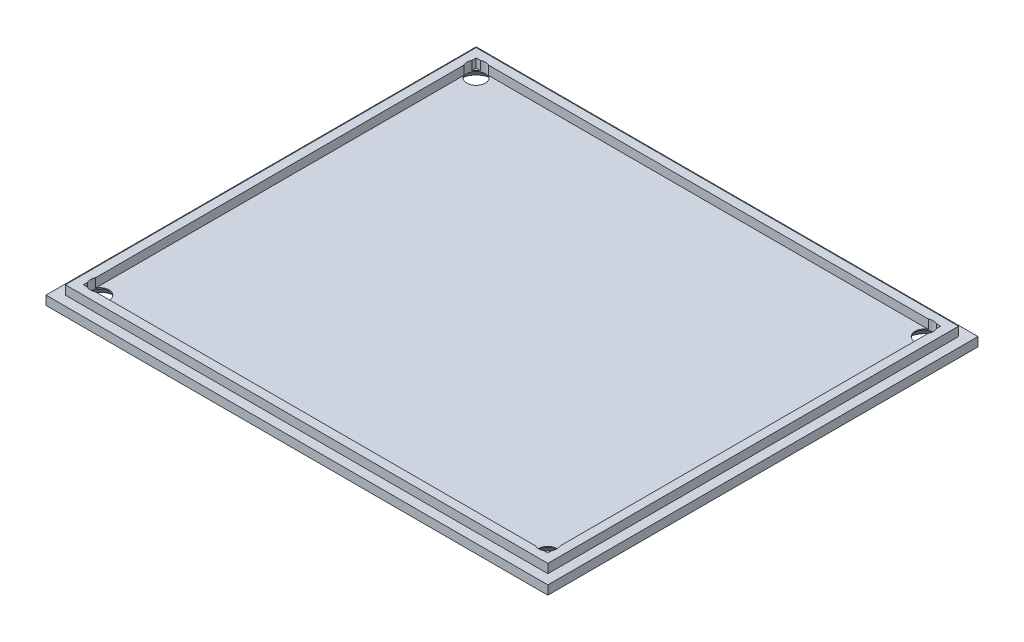
ISO-10303-21;
HEADER;
FILE_DESCRIPTION(('STEP AP214'),'2;1');
FILE_NAME('part.step','',(''),(''),'','','');
FILE_SCHEMA(('AUTOMOTIVE_DESIGN { 1 0 10303 214 1 1 1 1 }'));
ENDSEC;
DATA;
#1=APPLICATION_CONTEXT('core data for automotive mechanical design processes');
#2=APPLICATION_PROTOCOL_DEFINITION('international standard','automotive_design',2000,#1);
#3=PRODUCT_CONTEXT('',#1,'mechanical');
#4=PRODUCT('Part','Part','',(#3));
#5=PRODUCT_RELATED_PRODUCT_CATEGORY('part','',(#4));
#6=PRODUCT_DEFINITION_FORMATION('','',#4);
#7=PRODUCT_DEFINITION_CONTEXT('part definition',#1,'design');
#8=PRODUCT_DEFINITION('design','',#6,#7);
#9=PRODUCT_DEFINITION_SHAPE('','',#8);
#10=(LENGTH_UNIT() NAMED_UNIT(*) SI_UNIT(.MILLI.,.METRE.));
#11=(NAMED_UNIT(*) PLANE_ANGLE_UNIT() SI_UNIT($,.RADIAN.));
#12=(NAMED_UNIT(*) SI_UNIT($,.STERADIAN.) SOLID_ANGLE_UNIT());
#13=UNCERTAINTY_MEASURE_WITH_UNIT(LENGTH_MEASURE(1.E-05),#10,'distance_accuracy_value','');
#14=(GEOMETRIC_REPRESENTATION_CONTEXT(3) GLOBAL_UNCERTAINTY_ASSIGNED_CONTEXT((#13)) GLOBAL_UNIT_ASSIGNED_CONTEXT((#10,
#11,#12)) REPRESENTATION_CONTEXT('',''));
#15=CARTESIAN_POINT('',(0.,0.,0.));
#16=DIRECTION('',(0.,0.,1.));
#17=DIRECTION('',(1.,0.,0.));
#18=AXIS2_PLACEMENT_3D('',#15,#16,#17);
#19=CARTESIAN_POINT('',(41.148,3.175,34.798));
#20=DIRECTION('',(-1.,0.,0.));
#21=DIRECTION('',(0.,0.,1.));
#22=AXIS2_PLACEMENT_3D('',#19,#20,#21);
#23=PLANE('',#22);
#24=DIRECTION('',(0.,-1.,0.));
#25=VECTOR('',#24,1.);
#26=CARTESIAN_POINT('',(41.148,0.,-34.0656487159227));
#27=LINE('',#26,#25);
#28=CARTESIAN_POINT('',(41.148,3.175,-34.0656487159227));
#29=VERTEX_POINT('',#28);
#30=CARTESIAN_POINT('',(41.148,1.5875,-34.0656487159227));
#31=VERTEX_POINT('',#30);
#32=EDGE_CURVE('E454',#29,#31,#27,.T.);
#33=ORIENTED_EDGE('',*,*,#32,.F.);
#34=DIRECTION('',(0.,0.,-1.));
#35=VECTOR('',#34,1.);
#36=CARTESIAN_POINT('',(41.148,3.175,34.798));
#37=LINE('',#36,#35);
#38=CARTESIAN_POINT('',(41.148,3.175,-34.798));
#39=VERTEX_POINT('',#38);
#40=EDGE_CURVE('E428',#29,#39,#37,.T.);
#41=ORIENTED_EDGE('',*,*,#40,.T.);
#42=DIRECTION('',(0.,-1.,0.));
#43=VECTOR('',#42,1.);
#44=CARTESIAN_POINT('',(41.148,3.175,-34.798));
#45=LINE('',#44,#43);
#46=CARTESIAN_POINT('',(41.148,1.5875,-34.798));
#47=VERTEX_POINT('',#46);
#48=EDGE_CURVE('E276',#39,#47,#45,.T.);
#49=ORIENTED_EDGE('',*,*,#48,.T.);
#50=DIRECTION('',(0.,0.,-1.));
#51=VECTOR('',#50,1.);
#52=CARTESIAN_POINT('',(41.148,1.5875,34.798));
#53=LINE('',#52,#51);
#54=EDGE_CURVE('E254',#31,#47,#53,.T.);
#55=ORIENTED_EDGE('',*,*,#54,.F.);
#56=EDGE_LOOP('',(#33,#41,#49,#55));
#57=FACE_BOUND('',#56,.T.);
#58=ADVANCED_FACE('F32',(#57),#23,.T.);
#59=CARTESIAN_POINT('',(0.,1.5875,0.));
#60=DIRECTION('',(0.,1.,0.));
#61=DIRECTION('',(0.,0.,1.));
#62=AXIS2_PLACEMENT_3D('',#59,#60,#61);
#63=PLANE('',#62);
#64=CARTESIAN_POINT('',(39.6875,1.5875,-33.3375));
#65=DIRECTION('',(0.,1.,0.));
#66=DIRECTION('',(0.,0.,1.));
#67=AXIS2_PLACEMENT_3D('',#64,#65,#66);
#68=CIRCLE('',#67,1.63195);
#69=CARTESIAN_POINT('',(40.4156487159227,1.5875,-34.798));
#70=VERTEX_POINT('',#69);
#71=EDGE_CURVE('E459',#31,#70,#68,.T.);
#72=ORIENTED_EDGE('',*,*,#71,.F.);
#73=ORIENTED_EDGE('',*,*,#54,.T.);
#74=DIRECTION('',(-1.,0.,0.));
#75=VECTOR('',#74,1.);
#76=CARTESIAN_POINT('',(41.148,1.5875,-34.798));
#77=LINE('',#76,#75);
#78=EDGE_CURVE('E262',#47,#70,#77,.T.);
#79=ORIENTED_EDGE('',*,*,#78,.T.);
#80=EDGE_LOOP('',(#72,#73,#79));
#81=FACE_BOUND('',#80,.T.);
#82=ADVANCED_FACE('F539',(#81),#63,.T.);
#83=CARTESIAN_POINT('',(41.148,3.175,-34.798));
#84=DIRECTION('',(0.,0.,1.));
#85=DIRECTION('',(1.,0.,0.));
#86=AXIS2_PLACEMENT_3D('',#83,#84,#85);
#87=PLANE('',#86);
#88=DIRECTION('',(0.,-1.,0.));
#89=VECTOR('',#88,1.);
#90=CARTESIAN_POINT('',(38.9593512840772,0.,-34.798));
#91=LINE('',#90,#89);
#92=CARTESIAN_POINT('',(38.9593512840772,3.175,-34.798));
#93=VERTEX_POINT('',#92);
#94=CARTESIAN_POINT('',(38.9593512840772,1.5875,-34.798));
#95=VERTEX_POINT('',#94);
#96=EDGE_CURVE('E218',#93,#95,#91,.T.);
#97=ORIENTED_EDGE('',*,*,#96,.F.);
#98=DIRECTION('',(-1.,0.,0.));
#99=VECTOR('',#98,1.);
#100=CARTESIAN_POINT('',(41.148,3.175,-34.798));
#101=LINE('',#100,#99);
#102=CARTESIAN_POINT('',(-38.9593512840772,3.175,-34.798));
#103=VERTEX_POINT('',#102);
#104=EDGE_CURVE('E55',#93,#103,#101,.T.);
#105=ORIENTED_EDGE('',*,*,#104,.T.);
#106=DIRECTION('',(0.,-1.,0.));
#107=VECTOR('',#106,1.);
#108=CARTESIAN_POINT('',(-38.9593512840772,0.,-34.798));
#109=LINE('',#108,#107);
#110=CARTESIAN_POINT('',(-38.9593512840772,1.5875,-34.798));
#111=VERTEX_POINT('',#110);
#112=EDGE_CURVE('E369',#111,#103,#109,.F.);
#113=ORIENTED_EDGE('',*,*,#112,.F.);
#114=EDGE_CURVE('E228',#95,#111,#77,.T.);
#115=ORIENTED_EDGE('',*,*,#114,.F.);
#116=EDGE_LOOP('',(#97,#105,#113,#115));
#117=FACE_BOUND('',#116,.T.);
#118=ADVANCED_FACE('F227',(#117),#87,.T.);
#119=CARTESIAN_POINT('',(-39.6875,1.5875,-33.3375));
#120=DIRECTION('',(0.,1.,0.));
#121=DIRECTION('',(0.,0.,1.));
#122=AXIS2_PLACEMENT_3D('',#119,#120,#121);
#123=CIRCLE('',#122,1.63195);
#124=CARTESIAN_POINT('',(-40.4156487159229,1.5875,-34.798));
#125=VERTEX_POINT('',#124);
#126=CARTESIAN_POINT('',(-41.148,1.5875,-34.0656487159228));
#127=VERTEX_POINT('',#126);
#128=EDGE_CURVE('E372',#125,#127,#123,.T.);
#129=ORIENTED_EDGE('',*,*,#128,.F.);
#130=CARTESIAN_POINT('',(-41.148,1.5875,-34.798));
#131=VERTEX_POINT('',#130);
#132=EDGE_CURVE('E260',#125,#131,#77,.T.);
#133=ORIENTED_EDGE('',*,*,#132,.T.);
#134=DIRECTION('',(0.,0.,1.));
#135=VECTOR('',#134,1.);
#136=CARTESIAN_POINT('',(-41.148,1.5875,-34.798));
#137=LINE('',#136,#135);
#138=EDGE_CURVE('E266',#131,#127,#137,.T.);
#139=ORIENTED_EDGE('',*,*,#138,.T.);
#140=EDGE_LOOP('',(#129,#133,#139));
#141=FACE_BOUND('',#140,.T.);
#142=ADVANCED_FACE('F545',(#141),#63,.T.);
#143=DIRECTION('',(0.,-1.,0.));
#144=VECTOR('',#143,1.);
#145=CARTESIAN_POINT('',(-40.4156487159229,0.,-34.798));
#146=LINE('',#145,#144);
#147=CARTESIAN_POINT('',(-40.4156487159229,3.175,-34.798));
#148=VERTEX_POINT('',#147);
#149=EDGE_CURVE('E370',#148,#125,#146,.T.);
#150=ORIENTED_EDGE('',*,*,#149,.F.);
#151=CARTESIAN_POINT('',(-41.148,3.175,-34.798));
#152=VERTEX_POINT('',#151);
#153=EDGE_CURVE('E239',#148,#152,#101,.T.);
#154=ORIENTED_EDGE('',*,*,#153,.T.);
#155=DIRECTION('',(0.,-1.,0.));
#156=VECTOR('',#155,1.);
#157=CARTESIAN_POINT('',(-41.148,3.175,-34.798));
#158=LINE('',#157,#156);
#159=EDGE_CURVE('E273',#152,#131,#158,.T.);
#160=ORIENTED_EDGE('',*,*,#159,.T.);
#161=ORIENTED_EDGE('',*,*,#132,.F.);
#162=EDGE_LOOP('',(#150,#154,#160,#161));
#163=FACE_BOUND('',#162,.T.);
#164=ADVANCED_FACE('F555',(#163),#87,.T.);
#165=CARTESIAN_POINT('',(-41.148,3.175,-34.798));
#166=DIRECTION('',(1.,0.,0.));
#167=DIRECTION('',(0.,0.,-1.));
#168=AXIS2_PLACEMENT_3D('',#165,#166,#167);
#169=PLANE('',#168);
#170=DIRECTION('',(0.,-1.,0.));
#171=VECTOR('',#170,1.);
#172=CARTESIAN_POINT('',(-41.148,0.,-32.6093512840772));
#173=LINE('',#172,#171);
#174=CARTESIAN_POINT('',(-41.148,3.175,-32.6093512840772));
#175=VERTEX_POINT('',#174);
#176=CARTESIAN_POINT('',(-41.148,1.5875,-32.6093512840772));
#177=VERTEX_POINT('',#176);
#178=EDGE_CURVE('E40',#175,#177,#173,.T.);
#179=ORIENTED_EDGE('',*,*,#178,.F.);
#180=DIRECTION('',(0.,0.,1.));
#181=VECTOR('',#180,1.);
#182=CARTESIAN_POINT('',(-41.148,3.175,-34.798));
#183=LINE('',#182,#181);
#184=CARTESIAN_POINT('',(-41.148,3.175,32.6093512840771));
#185=VERTEX_POINT('',#184);
#186=EDGE_CURVE('E250',#175,#185,#183,.T.);
#187=ORIENTED_EDGE('',*,*,#186,.T.);
#188=DIRECTION('',(0.,-1.,0.));
#189=VECTOR('',#188,1.);
#190=CARTESIAN_POINT('',(-41.148,0.,32.6093512840771));
#191=LINE('',#190,#189);
#192=CARTESIAN_POINT('',(-41.148,1.5875,32.6093512840771));
#193=VERTEX_POINT('',#192);
#194=EDGE_CURVE('E376',#193,#185,#191,.F.);
#195=ORIENTED_EDGE('',*,*,#194,.F.);
#196=EDGE_CURVE('E270',#177,#193,#137,.T.);
#197=ORIENTED_EDGE('',*,*,#196,.F.);
#198=EDGE_LOOP('',(#179,#187,#195,#197));
#199=FACE_BOUND('',#198,.T.);
#200=ADVANCED_FACE('F374',(#199),#169,.T.);
#201=CARTESIAN_POINT('',(0.,3.175,0.));
#202=DIRECTION('',(0.,1.,0.));
#203=DIRECTION('',(0.,0.,1.));
#204=AXIS2_PLACEMENT_3D('',#201,#202,#203);
#205=PLANE('',#204);
#206=CARTESIAN_POINT('',(39.6875,3.175,-33.3375));
#207=DIRECTION('',(0.,1.,0.));
#208=DIRECTION('',(0.,0.,1.));
#209=AXIS2_PLACEMENT_3D('',#206,#207,#208);
#210=CIRCLE('',#209,1.63195);
#211=CARTESIAN_POINT('',(41.148,3.175,-32.6093512840773));
#212=VERTEX_POINT('',#211);
#213=EDGE_CURVE('E11',#212,#29,#210,.T.);
#214=ORIENTED_EDGE('',*,*,#213,.F.);
#215=CARTESIAN_POINT('',(41.148,3.175,32.6093512840773));
#216=VERTEX_POINT('',#215);
#217=EDGE_CURVE('E430',#216,#212,#37,.T.);
#218=ORIENTED_EDGE('',*,*,#217,.F.);
#219=CARTESIAN_POINT('',(39.6875,3.175,33.3375));
#220=DIRECTION('',(0.,1.,0.));
#221=DIRECTION('',(0.,0.,1.));
#222=AXIS2_PLACEMENT_3D('',#219,#220,#221);
#223=CIRCLE('',#222,1.63195);
#224=CARTESIAN_POINT('',(41.148,3.175,34.0656487159227));
#225=VERTEX_POINT('',#224);
#226=EDGE_CURVE('E346',#216,#225,#223,.F.);
#227=ORIENTED_EDGE('',*,*,#226,.T.);
#228=CARTESIAN_POINT('',(41.148,3.175,34.798));
#229=VERTEX_POINT('',#228);
#230=EDGE_CURVE('E242',#229,#225,#37,.T.);
#231=ORIENTED_EDGE('',*,*,#230,.F.);
#232=DIRECTION('',(1.,0.,0.));
#233=VECTOR('',#232,1.);
#234=CARTESIAN_POINT('',(-41.148,3.175,34.798));
#235=LINE('',#234,#233);
#236=CARTESIAN_POINT('',(40.4156487159228,3.175,34.798));
#237=VERTEX_POINT('',#236);
#238=EDGE_CURVE('E269',#237,#229,#235,.T.);
#239=ORIENTED_EDGE('',*,*,#238,.F.);
#240=CARTESIAN_POINT('',(38.9593512840772,3.175,34.798));
#241=VERTEX_POINT('',#240);
#242=EDGE_CURVE('E341',#237,#241,#223,.F.);
#243=ORIENTED_EDGE('',*,*,#242,.T.);
#244=CARTESIAN_POINT('',(-38.9593512840773,3.175,34.798));
#245=VERTEX_POINT('',#244);
#246=EDGE_CURVE('E429',#245,#241,#235,.T.);
#247=ORIENTED_EDGE('',*,*,#246,.F.);
#248=CARTESIAN_POINT('',(-39.6875,3.175,33.3375));
#249=DIRECTION('',(0.,1.,0.));
#250=DIRECTION('',(0.,0.,1.));
#251=AXIS2_PLACEMENT_3D('',#248,#249,#250);
#252=CIRCLE('',#251,1.63195);
#253=CARTESIAN_POINT('',(-40.4156487159228,3.175,34.798));
#254=VERTEX_POINT('',#253);
#255=EDGE_CURVE('E403',#245,#254,#252,.F.);
#256=ORIENTED_EDGE('',*,*,#255,.T.);
#257=CARTESIAN_POINT('',(-41.148,3.175,34.798));
#258=VERTEX_POINT('',#257);
#259=EDGE_CURVE('E427',#258,#254,#235,.T.);
#260=ORIENTED_EDGE('',*,*,#259,.F.);
#261=CARTESIAN_POINT('',(-41.148,3.175,34.0656487159228));
#262=VERTEX_POINT('',#261);
#263=EDGE_CURVE('E241',#262,#258,#183,.T.);
#264=ORIENTED_EDGE('',*,*,#263,.F.);
#265=EDGE_CURVE('E398',#262,#185,#252,.F.);
#266=ORIENTED_EDGE('',*,*,#265,.T.);
#267=ORIENTED_EDGE('',*,*,#186,.F.);
#268=CARTESIAN_POINT('',(-39.6875,3.175,-33.3375));
#269=DIRECTION('',(0.,1.,0.));
#270=DIRECTION('',(0.,0.,1.));
#271=AXIS2_PLACEMENT_3D('',#268,#269,#270);
#272=CIRCLE('',#271,1.63195);
#273=CARTESIAN_POINT('',(-41.148,3.175,-34.0656487159228));
#274=VERTEX_POINT('',#273);
#275=EDGE_CURVE('E361',#175,#274,#272,.F.);
#276=ORIENTED_EDGE('',*,*,#275,.T.);
#277=EDGE_CURVE('E246',#152,#274,#183,.T.);
#278=ORIENTED_EDGE('',*,*,#277,.F.);
#279=ORIENTED_EDGE('',*,*,#153,.F.);
#280=EDGE_CURVE('E237',#148,#103,#272,.F.);
#281=ORIENTED_EDGE('',*,*,#280,.T.);
#282=ORIENTED_EDGE('',*,*,#104,.F.);
#283=CARTESIAN_POINT('',(39.6875,3.175,-33.3375));
#284=DIRECTION('',(0.,1.,0.));
#285=DIRECTION('',(0.,0.,1.));
#286=AXIS2_PLACEMENT_3D('',#283,#284,#285);
#287=CIRCLE('',#286,1.63195);
#288=CARTESIAN_POINT('',(40.4156487159227,3.175,-34.798));
#289=VERTEX_POINT('',#288);
#290=EDGE_CURVE('E215',#93,#289,#287,.F.);
#291=ORIENTED_EDGE('',*,*,#290,.T.);
#292=EDGE_CURVE('E238',#39,#289,#101,.T.);
#293=ORIENTED_EDGE('',*,*,#292,.F.);
#294=ORIENTED_EDGE('',*,*,#40,.F.);
#295=EDGE_LOOP('',(#214,#218,#227,#231,#239,#243,#247,#256,#260,#264,#266,#267,#276,#278,#279,
#281,#282,#291,#293,#294));
#296=FACE_BOUND('',#295,.T.);
#297=DIRECTION('',(1.,0.,0.));
#298=VECTOR('',#297,1.);
#299=CARTESIAN_POINT('',(-42.7355,3.175,36.3855));
#300=LINE('',#299,#298);
#301=CARTESIAN_POINT('',(-42.7355,3.175,36.3855));
#302=VERTEX_POINT('',#301);
#303=CARTESIAN_POINT('',(42.7355,3.175,36.3855));
#304=VERTEX_POINT('',#303);
#305=EDGE_CURVE('E283',#302,#304,#300,.T.);
#306=ORIENTED_EDGE('',*,*,#305,.T.);
#307=DIRECTION('',(0.,0.,-1.));
#308=VECTOR('',#307,1.);
#309=CARTESIAN_POINT('',(42.7355,3.175,36.3855));
#310=LINE('',#309,#308);
#311=CARTESIAN_POINT('',(42.7355,3.175,-36.3855));
#312=VERTEX_POINT('',#311);
#313=EDGE_CURVE('E286',#304,#312,#310,.T.);
#314=ORIENTED_EDGE('',*,*,#313,.T.);
#315=DIRECTION('',(-1.,0.,0.));
#316=VECTOR('',#315,1.);
#317=CARTESIAN_POINT('',(42.7355,3.175,-36.3855));
#318=LINE('',#317,#316);
#319=CARTESIAN_POINT('',(-42.7355,3.175,-36.3855));
#320=VERTEX_POINT('',#319);
#321=EDGE_CURVE('E289',#312,#320,#318,.T.);
#322=ORIENTED_EDGE('',*,*,#321,.T.);
#323=DIRECTION('',(0.,0.,1.));
#324=VECTOR('',#323,1.);
#325=CARTESIAN_POINT('',(-42.7355,3.175,-36.3855));
#326=LINE('',#325,#324);
#327=EDGE_CURVE('E291',#320,#302,#326,.T.);
#328=ORIENTED_EDGE('',*,*,#327,.T.);
#329=EDGE_LOOP('',(#306,#314,#322,#328));
#330=FACE_BOUND('',#329,.T.);
#331=ADVANCED_FACE('F234',(#296,#330),#205,.T.);
#332=DIRECTION('',(0.,-1.,0.));
#333=VECTOR('',#332,1.);
#334=CARTESIAN_POINT('',(-41.148,0.,34.0656487159228));
#335=LINE('',#334,#333);
#336=CARTESIAN_POINT('',(-41.148,1.5875,34.0656487159228));
#337=VERTEX_POINT('',#336);
#338=EDGE_CURVE('E393',#262,#337,#335,.T.);
#339=ORIENTED_EDGE('',*,*,#338,.F.);
#340=ORIENTED_EDGE('',*,*,#263,.T.);
#341=DIRECTION('',(0.,-1.,0.));
#342=VECTOR('',#341,1.);
#343=CARTESIAN_POINT('',(-41.148,3.175,34.798));
#344=LINE('',#343,#342);
#345=CARTESIAN_POINT('',(-41.148,1.5875,34.798));
#346=VERTEX_POINT('',#345);
#347=EDGE_CURVE('E249',#258,#346,#344,.T.);
#348=ORIENTED_EDGE('',*,*,#347,.T.);
#349=EDGE_CURVE('E265',#337,#346,#137,.T.);
#350=ORIENTED_EDGE('',*,*,#349,.F.);
#351=EDGE_LOOP('',(#339,#340,#348,#350));
#352=FACE_BOUND('',#351,.T.);
#353=ADVANCED_FACE('F391',(#352),#169,.T.);
#354=CARTESIAN_POINT('',(41.148,1.5875,-32.6093512840773));
#355=VERTEX_POINT('',#354);
#356=EDGE_CURVE('E230',#95,#355,#68,.T.);
#357=ORIENTED_EDGE('',*,*,#356,.F.);
#358=ORIENTED_EDGE('',*,*,#114,.T.);
#359=EDGE_CURVE('E359',#177,#111,#123,.T.);
#360=ORIENTED_EDGE('',*,*,#359,.F.);
#361=ORIENTED_EDGE('',*,*,#196,.T.);
#362=CARTESIAN_POINT('',(-39.6875,1.5875,33.3375));
#363=DIRECTION('',(0.,1.,0.));
#364=DIRECTION('',(0.,0.,1.));
#365=AXIS2_PLACEMENT_3D('',#362,#363,#364);
#366=CIRCLE('',#365,1.63195);
#367=CARTESIAN_POINT('',(-38.9593512840773,1.5875,34.798));
#368=VERTEX_POINT('',#367);
#369=EDGE_CURVE('E399',#368,#193,#366,.T.);
#370=ORIENTED_EDGE('',*,*,#369,.F.);
#371=DIRECTION('',(1.,0.,0.));
#372=VECTOR('',#371,1.);
#373=CARTESIAN_POINT('',(-41.148,1.5875,34.798));
#374=LINE('',#373,#372);
#375=CARTESIAN_POINT('',(38.9593512840772,1.5875,34.798));
#376=VERTEX_POINT('',#375);
#377=EDGE_CURVE('E255',#368,#376,#374,.T.);
#378=ORIENTED_EDGE('',*,*,#377,.T.);
#379=CARTESIAN_POINT('',(39.6875,1.5875,33.3375));
#380=DIRECTION('',(0.,1.,0.));
#381=DIRECTION('',(0.,0.,1.));
#382=AXIS2_PLACEMENT_3D('',#379,#380,#381);
#383=CIRCLE('',#382,1.63195);
#384=CARTESIAN_POINT('',(41.148,1.5875,32.6093512840773));
#385=VERTEX_POINT('',#384);
#386=EDGE_CURVE('E416',#385,#376,#383,.T.);
#387=ORIENTED_EDGE('',*,*,#386,.F.);
#388=EDGE_CURVE('E261',#385,#355,#53,.T.);
#389=ORIENTED_EDGE('',*,*,#388,.T.);
#390=EDGE_LOOP('',(#357,#358,#360,#361,#370,#378,#387,#389));
#391=FACE_BOUND('',#390,.T.);
#392=ADVANCED_FACE('F366',(#391),#63,.T.);
#393=CARTESIAN_POINT('',(-41.148,3.175,34.798));
#394=DIRECTION('',(0.,0.,-1.));
#395=DIRECTION('',(-1.,0.,0.));
#396=AXIS2_PLACEMENT_3D('',#393,#394,#395);
#397=PLANE('',#396);
#398=DIRECTION('',(0.,-1.,0.));
#399=VECTOR('',#398,1.);
#400=CARTESIAN_POINT('',(-38.9593512840773,0.,34.798));
#401=LINE('',#400,#399);
#402=EDGE_CURVE('E350',#245,#368,#401,.T.);
#403=ORIENTED_EDGE('',*,*,#402,.F.);
#404=ORIENTED_EDGE('',*,*,#246,.T.);
#405=DIRECTION('',(0.,-1.,0.));
#406=VECTOR('',#405,1.);
#407=CARTESIAN_POINT('',(38.9593512840772,0.,34.798));
#408=LINE('',#407,#406);
#409=EDGE_CURVE('E342',#376,#241,#408,.F.);
#410=ORIENTED_EDGE('',*,*,#409,.F.);
#411=ORIENTED_EDGE('',*,*,#377,.F.);
#412=EDGE_LOOP('',(#403,#404,#410,#411));
#413=FACE_BOUND('',#412,.T.);
#414=ADVANCED_FACE('F535',(#413),#397,.T.);
#415=CARTESIAN_POINT('',(40.4156487159228,1.5875,34.798));
#416=VERTEX_POINT('',#415);
#417=CARTESIAN_POINT('',(41.148,1.5875,34.0656487159227));
#418=VERTEX_POINT('',#417);
#419=EDGE_CURVE('E424',#416,#418,#383,.T.);
#420=ORIENTED_EDGE('',*,*,#419,.F.);
#421=CARTESIAN_POINT('',(41.148,1.5875,34.798));
#422=VERTEX_POINT('',#421);
#423=EDGE_CURVE('E256',#416,#422,#374,.T.);
#424=ORIENTED_EDGE('',*,*,#423,.T.);
#425=EDGE_CURVE('E257',#422,#418,#53,.T.);
#426=ORIENTED_EDGE('',*,*,#425,.T.);
#427=EDGE_LOOP('',(#420,#424,#426));
#428=FACE_BOUND('',#427,.T.);
#429=ADVANCED_FACE('F508',(#428),#63,.T.);
#430=DIRECTION('',(0.,-1.,0.));
#431=VECTOR('',#430,1.);
#432=CARTESIAN_POINT('',(41.148,0.,-32.6093512840773));
#433=LINE('',#432,#431);
#434=EDGE_CURVE('E229',#355,#212,#433,.F.);
#435=ORIENTED_EDGE('',*,*,#434,.F.);
#436=ORIENTED_EDGE('',*,*,#388,.F.);
#437=DIRECTION('',(0.,-1.,0.));
#438=VECTOR('',#437,1.);
#439=CARTESIAN_POINT('',(41.148,0.,32.6093512840773));
#440=LINE('',#439,#438);
#441=EDGE_CURVE('E423',#216,#385,#440,.T.);
#442=ORIENTED_EDGE('',*,*,#441,.F.);
#443=ORIENTED_EDGE('',*,*,#217,.T.);
#444=EDGE_LOOP('',(#435,#436,#442,#443));
#445=FACE_BOUND('',#444,.T.);
#446=ADVANCED_FACE('F449',(#445),#23,.T.);
#447=DIRECTION('',(0.,-1.,0.));
#448=VECTOR('',#447,1.);
#449=CARTESIAN_POINT('',(40.4156487159228,0.,34.798));
#450=LINE('',#449,#448);
#451=EDGE_CURVE('E345',#237,#416,#450,.T.);
#452=ORIENTED_EDGE('',*,*,#451,.F.);
#453=ORIENTED_EDGE('',*,*,#238,.T.);
#454=DIRECTION('',(0.,-1.,0.));
#455=VECTOR('',#454,1.);
#456=CARTESIAN_POINT('',(41.148,3.175,34.798));
#457=LINE('',#456,#455);
#458=EDGE_CURVE('E279',#229,#422,#457,.T.);
#459=ORIENTED_EDGE('',*,*,#458,.T.);
#460=ORIENTED_EDGE('',*,*,#423,.F.);
#461=EDGE_LOOP('',(#452,#453,#459,#460));
#462=FACE_BOUND('',#461,.T.);
#463=ADVANCED_FACE('F435',(#462),#397,.T.);
#464=DIRECTION('',(0.,0.,-1.));
#465=VECTOR('',#464,1.);
#466=CARTESIAN_POINT('',(44.45,1.5875,-38.1));
#467=LINE('',#466,#465);
#468=CARTESIAN_POINT('',(44.45,1.5875,38.1));
#469=VERTEX_POINT('',#468);
#470=CARTESIAN_POINT('',(44.45,1.5875,-38.1));
#471=VERTEX_POINT('',#470);
#472=EDGE_CURVE('E312',#469,#471,#467,.T.);
#473=ORIENTED_EDGE('',*,*,#472,.T.);
#474=DIRECTION('',(-1.,0.,0.));
#475=VECTOR('',#474,1.);
#476=CARTESIAN_POINT('',(-44.45,1.5875,-38.1));
#477=LINE('',#476,#475);
#478=CARTESIAN_POINT('',(-44.45,1.5875,-38.1));
#479=VERTEX_POINT('',#478);
#480=EDGE_CURVE('E315',#471,#479,#477,.T.);
#481=ORIENTED_EDGE('',*,*,#480,.T.);
#482=DIRECTION('',(0.,0.,1.));
#483=VECTOR('',#482,1.);
#484=CARTESIAN_POINT('',(-44.45,1.5875,-38.1));
#485=LINE('',#484,#483);
#486=CARTESIAN_POINT('',(-44.45,1.5875,38.1));
#487=VERTEX_POINT('',#486);
#488=EDGE_CURVE('E318',#479,#487,#485,.T.);
#489=ORIENTED_EDGE('',*,*,#488,.T.);
#490=DIRECTION('',(1.,0.,0.));
#491=VECTOR('',#490,1.);
#492=CARTESIAN_POINT('',(-44.45,1.5875,38.1));
#493=LINE('',#492,#491);
#494=EDGE_CURVE('E320',#487,#469,#493,.T.);
#495=ORIENTED_EDGE('',*,*,#494,.T.);
#496=EDGE_LOOP('',(#473,#481,#489,#495));
#497=FACE_BOUND('',#496,.T.);
#498=DIRECTION('',(0.,0.,-1.));
#499=VECTOR('',#498,1.);
#500=CARTESIAN_POINT('',(42.7355,1.5875,36.3855));
#501=LINE('',#500,#499);
#502=CARTESIAN_POINT('',(42.7355,1.5875,36.3855));
#503=VERTEX_POINT('',#502);
#504=CARTESIAN_POINT('',(42.7355,1.5875,-36.3855));
#505=VERTEX_POINT('',#504);
#506=EDGE_CURVE('E296',#503,#505,#501,.T.);
#507=ORIENTED_EDGE('',*,*,#506,.F.);
#508=DIRECTION('',(1.,0.,0.));
#509=VECTOR('',#508,1.);
#510=CARTESIAN_POINT('',(-42.7355,1.5875,36.3855));
#511=LINE('',#510,#509);
#512=CARTESIAN_POINT('',(-42.7355,1.5875,36.3855));
#513=VERTEX_POINT('',#512);
#514=EDGE_CURVE('E282',#513,#503,#511,.T.);
#515=ORIENTED_EDGE('',*,*,#514,.F.);
#516=DIRECTION('',(0.,0.,1.));
#517=VECTOR('',#516,1.);
#518=CARTESIAN_POINT('',(-42.7355,1.5875,-36.3855));
#519=LINE('',#518,#517);
#520=CARTESIAN_POINT('',(-42.7355,1.5875,-36.3855));
#521=VERTEX_POINT('',#520);
#522=EDGE_CURVE('E287',#521,#513,#519,.T.);
#523=ORIENTED_EDGE('',*,*,#522,.F.);
#524=DIRECTION('',(-1.,0.,0.));
#525=VECTOR('',#524,1.);
#526=CARTESIAN_POINT('',(42.7355,1.5875,-36.3855));
#527=LINE('',#526,#525);
#528=EDGE_CURVE('E298',#505,#521,#527,.T.);
#529=ORIENTED_EDGE('',*,*,#528,.F.);
#530=EDGE_LOOP('',(#507,#515,#523,#529));
#531=FACE_BOUND('',#530,.T.);
#532=ADVANCED_FACE('F504',(#497,#531),#63,.T.);
#533=CARTESIAN_POINT('',(44.45,1.5875,-38.1));
#534=DIRECTION('',(-1.,0.,0.));
#535=DIRECTION('',(0.,0.,1.));
#536=AXIS2_PLACEMENT_3D('',#533,#534,#535);
#537=PLANE('',#536);
#538=DIRECTION('',(0.,0.,-1.));
#539=VECTOR('',#538,1.);
#540=CARTESIAN_POINT('',(44.45,0.,-38.1));
#541=LINE('',#540,#539);
#542=CARTESIAN_POINT('',(44.45,0.,38.1));
#543=VERTEX_POINT('',#542);
#544=CARTESIAN_POINT('',(44.45,0.,-38.1));
#545=VERTEX_POINT('',#544);
#546=EDGE_CURVE('E311',#543,#545,#541,.T.);
#547=ORIENTED_EDGE('',*,*,#546,.T.);
#548=DIRECTION('',(0.,-1.,0.));
#549=VECTOR('',#548,1.);
#550=CARTESIAN_POINT('',(44.45,1.5875,-38.1));
#551=LINE('',#550,#549);
#552=EDGE_CURVE('E338',#471,#545,#551,.T.);
#553=ORIENTED_EDGE('',*,*,#552,.F.);
#554=ORIENTED_EDGE('',*,*,#472,.F.);
#555=DIRECTION('',(0.,-1.,0.));
#556=VECTOR('',#555,1.);
#557=CARTESIAN_POINT('',(44.45,1.5875,38.1));
#558=LINE('',#557,#556);
#559=EDGE_CURVE('E322',#469,#543,#558,.T.);
#560=ORIENTED_EDGE('',*,*,#559,.T.);
#561=EDGE_LOOP('',(#547,#553,#554,#560));
#562=FACE_BOUND('',#561,.T.);
#563=ADVANCED_FACE('F34',(#562),#537,.F.);
#564=CARTESIAN_POINT('',(-44.45,1.5875,-38.1));
#565=DIRECTION('',(0.,0.,1.));
#566=DIRECTION('',(1.,0.,0.));
#567=AXIS2_PLACEMENT_3D('',#564,#565,#566);
#568=PLANE('',#567);
#569=DIRECTION('',(-1.,0.,0.));
#570=VECTOR('',#569,1.);
#571=CARTESIAN_POINT('',(-44.45,0.,-38.1));
#572=LINE('',#571,#570);
#573=CARTESIAN_POINT('',(-44.45,0.,-38.1));
#574=VERTEX_POINT('',#573);
#575=EDGE_CURVE('E325',#545,#574,#572,.T.);
#576=ORIENTED_EDGE('',*,*,#575,.T.);
#577=DIRECTION('',(0.,-1.,0.));
#578=VECTOR('',#577,1.);
#579=CARTESIAN_POINT('',(-44.45,1.5875,-38.1));
#580=LINE('',#579,#578);
#581=EDGE_CURVE('E335',#479,#574,#580,.T.);
#582=ORIENTED_EDGE('',*,*,#581,.F.);
#583=ORIENTED_EDGE('',*,*,#480,.F.);
#584=ORIENTED_EDGE('',*,*,#552,.T.);
#585=EDGE_LOOP('',(#576,#582,#583,#584));
#586=FACE_BOUND('',#585,.T.);
#587=ADVANCED_FACE('F502',(#586),#568,.F.);
#588=CARTESIAN_POINT('',(-44.45,1.5875,-38.1));
#589=DIRECTION('',(1.,0.,0.));
#590=DIRECTION('',(0.,0.,-1.));
#591=AXIS2_PLACEMENT_3D('',#588,#589,#590);
#592=PLANE('',#591);
#593=DIRECTION('',(0.,0.,1.));
#594=VECTOR('',#593,1.);
#595=CARTESIAN_POINT('',(-44.45,0.,-38.1));
#596=LINE('',#595,#594);
#597=CARTESIAN_POINT('',(-44.45,0.,38.1));
#598=VERTEX_POINT('',#597);
#599=EDGE_CURVE('E327',#574,#598,#596,.T.);
#600=ORIENTED_EDGE('',*,*,#599,.T.);
#601=DIRECTION('',(0.,-1.,0.));
#602=VECTOR('',#601,1.);
#603=CARTESIAN_POINT('',(-44.45,1.5875,38.1));
#604=LINE('',#603,#602);
#605=EDGE_CURVE('E332',#487,#598,#604,.T.);
#606=ORIENTED_EDGE('',*,*,#605,.F.);
#607=ORIENTED_EDGE('',*,*,#488,.F.);
#608=ORIENTED_EDGE('',*,*,#581,.T.);
#609=EDGE_LOOP('',(#600,#606,#607,#608));
#610=FACE_BOUND('',#609,.T.);
#611=ADVANCED_FACE('F499',(#610),#592,.F.);
#612=CARTESIAN_POINT('',(-44.45,1.5875,38.1));
#613=DIRECTION('',(0.,0.,-1.));
#614=DIRECTION('',(-1.,0.,0.));
#615=AXIS2_PLACEMENT_3D('',#612,#613,#614);
#616=PLANE('',#615);
#617=DIRECTION('',(1.,0.,0.));
#618=VECTOR('',#617,1.);
#619=CARTESIAN_POINT('',(-44.45,0.,38.1));
#620=LINE('',#619,#618);
#621=EDGE_CURVE('E316',#598,#543,#620,.T.);
#622=ORIENTED_EDGE('',*,*,#621,.T.);
#623=ORIENTED_EDGE('',*,*,#559,.F.);
#624=ORIENTED_EDGE('',*,*,#494,.F.);
#625=ORIENTED_EDGE('',*,*,#605,.T.);
#626=EDGE_LOOP('',(#622,#623,#624,#625));
#627=FACE_BOUND('',#626,.T.);
#628=ADVANCED_FACE('F482',(#627),#616,.F.);
#629=CARTESIAN_POINT('',(0.,0.,0.));
#630=DIRECTION('',(0.,1.,0.));
#631=DIRECTION('',(0.,0.,1.));
#632=AXIS2_PLACEMENT_3D('',#629,#630,#631);
#633=PLANE('',#632);
#634=CARTESIAN_POINT('',(39.6875,0.,-33.3375));
#635=DIRECTION('',(0.,-1.,0.));
#636=DIRECTION('',(0.,0.,-1.));
#637=AXIS2_PLACEMENT_3D('',#634,#635,#636);
#638=CIRCLE('',#637,2.8575);
#639=CARTESIAN_POINT('',(39.6875,0.,-36.195));
#640=VERTEX_POINT('',#639);
#641=EDGE_CURVE('E224',#640,#640,#638,.T.);
#642=ORIENTED_EDGE('',*,*,#641,.F.);
#643=EDGE_LOOP('',(#642));
#644=FACE_BOUND('',#643,.T.);
#645=CARTESIAN_POINT('',(-39.6875,0.,-33.3375));
#646=DIRECTION('',(0.,-1.,0.));
#647=DIRECTION('',(0.,0.,-1.));
#648=AXIS2_PLACEMENT_3D('',#645,#646,#647);
#649=CIRCLE('',#648,2.8575);
#650=CARTESIAN_POINT('',(-39.6875,0.,-36.195));
#651=VERTEX_POINT('',#650);
#652=EDGE_CURVE('E465',#651,#651,#649,.T.);
#653=ORIENTED_EDGE('',*,*,#652,.F.);
#654=EDGE_LOOP('',(#653));
#655=FACE_BOUND('',#654,.T.);
#656=CARTESIAN_POINT('',(-39.6875,0.,33.3375));
#657=DIRECTION('',(0.,-1.,0.));
#658=DIRECTION('',(0.,0.,-1.));
#659=AXIS2_PLACEMENT_3D('',#656,#657,#658);
#660=CIRCLE('',#659,2.8575);
#661=CARTESIAN_POINT('',(-39.6875,0.,30.48));
#662=VERTEX_POINT('',#661);
#663=EDGE_CURVE('E408',#662,#662,#660,.T.);
#664=ORIENTED_EDGE('',*,*,#663,.F.);
#665=EDGE_LOOP('',(#664));
#666=FACE_BOUND('',#665,.T.);
#667=CARTESIAN_POINT('',(39.6875,0.,33.3375));
#668=DIRECTION('',(0.,-1.,0.));
#669=DIRECTION('',(0.,0.,-1.));
#670=AXIS2_PLACEMENT_3D('',#667,#668,#669);
#671=CIRCLE('',#670,2.8575);
#672=CARTESIAN_POINT('',(39.6875,0.,30.48));
#673=VERTEX_POINT('',#672);
#674=EDGE_CURVE('E400',#673,#673,#671,.T.);
#675=ORIENTED_EDGE('',*,*,#674,.F.);
#676=EDGE_LOOP('',(#675));
#677=FACE_BOUND('',#676,.T.);
#678=ORIENTED_EDGE('',*,*,#546,.F.);
#679=ORIENTED_EDGE('',*,*,#621,.F.);
#680=ORIENTED_EDGE('',*,*,#599,.F.);
#681=ORIENTED_EDGE('',*,*,#575,.F.);
#682=EDGE_LOOP('',(#678,#679,#680,#681));
#683=FACE_BOUND('',#682,.T.);
#684=ADVANCED_FACE('F478',(#644,#655,#666,#677,#683),#633,.F.);
#685=CARTESIAN_POINT('',(-42.7355,3.175,36.3855));
#686=DIRECTION('',(0.,0.,-1.));
#687=DIRECTION('',(-1.,0.,0.));
#688=AXIS2_PLACEMENT_3D('',#685,#686,#687);
#689=PLANE('',#688);
#690=ORIENTED_EDGE('',*,*,#514,.T.);
#691=DIRECTION('',(0.,-1.,0.));
#692=VECTOR('',#691,1.);
#693=CARTESIAN_POINT('',(42.7355,3.175,36.3855));
#694=LINE('',#693,#692);
#695=EDGE_CURVE('E309',#304,#503,#694,.T.);
#696=ORIENTED_EDGE('',*,*,#695,.F.);
#697=ORIENTED_EDGE('',*,*,#305,.F.);
#698=DIRECTION('',(0.,-1.,0.));
#699=VECTOR('',#698,1.);
#700=CARTESIAN_POINT('',(-42.7355,3.175,36.3855));
#701=LINE('',#700,#699);
#702=EDGE_CURVE('E293',#302,#513,#701,.T.);
#703=ORIENTED_EDGE('',*,*,#702,.T.);
#704=EDGE_LOOP('',(#690,#696,#697,#703));
#705=FACE_BOUND('',#704,.T.);
#706=ADVANCED_FACE('F481',(#705),#689,.F.);
#707=CARTESIAN_POINT('',(42.7355,3.175,36.3855));
#708=DIRECTION('',(-1.,0.,0.));
#709=DIRECTION('',(0.,0.,1.));
#710=AXIS2_PLACEMENT_3D('',#707,#708,#709);
#711=PLANE('',#710);
#712=ORIENTED_EDGE('',*,*,#506,.T.);
#713=DIRECTION('',(0.,-1.,0.));
#714=VECTOR('',#713,1.);
#715=CARTESIAN_POINT('',(42.7355,3.175,-36.3855));
#716=LINE('',#715,#714);
#717=EDGE_CURVE('E306',#312,#505,#716,.T.);
#718=ORIENTED_EDGE('',*,*,#717,.F.);
#719=ORIENTED_EDGE('',*,*,#313,.F.);
#720=ORIENTED_EDGE('',*,*,#695,.T.);
#721=EDGE_LOOP('',(#712,#718,#719,#720));
#722=FACE_BOUND('',#721,.T.);
#723=ADVANCED_FACE('F515',(#722),#711,.F.);
#724=CARTESIAN_POINT('',(42.7355,3.175,-36.3855));
#725=DIRECTION('',(0.,0.,1.));
#726=DIRECTION('',(1.,0.,0.));
#727=AXIS2_PLACEMENT_3D('',#724,#725,#726);
#728=PLANE('',#727);
#729=ORIENTED_EDGE('',*,*,#528,.T.);
#730=DIRECTION('',(0.,-1.,0.));
#731=VECTOR('',#730,1.);
#732=CARTESIAN_POINT('',(-42.7355,3.175,-36.3855));
#733=LINE('',#732,#731);
#734=EDGE_CURVE('E304',#320,#521,#733,.T.);
#735=ORIENTED_EDGE('',*,*,#734,.F.);
#736=ORIENTED_EDGE('',*,*,#321,.F.);
#737=ORIENTED_EDGE('',*,*,#717,.T.);
#738=EDGE_LOOP('',(#729,#735,#736,#737));
#739=FACE_BOUND('',#738,.T.);
#740=ADVANCED_FACE('F519',(#739),#728,.F.);
#741=CARTESIAN_POINT('',(-42.7355,3.175,-36.3855));
#742=DIRECTION('',(1.,0.,0.));
#743=DIRECTION('',(0.,0.,-1.));
#744=AXIS2_PLACEMENT_3D('',#741,#742,#743);
#745=PLANE('',#744);
#746=ORIENTED_EDGE('',*,*,#522,.T.);
#747=ORIENTED_EDGE('',*,*,#702,.F.);
#748=ORIENTED_EDGE('',*,*,#327,.F.);
#749=ORIENTED_EDGE('',*,*,#734,.T.);
#750=EDGE_LOOP('',(#746,#747,#748,#749));
#751=FACE_BOUND('',#750,.T.);
#752=ADVANCED_FACE('F526',(#751),#745,.F.);
#753=DIRECTION('',(0.,-1.,0.));
#754=VECTOR('',#753,1.);
#755=CARTESIAN_POINT('',(-40.4156487159228,0.,34.798));
#756=LINE('',#755,#754);
#757=CARTESIAN_POINT('',(-40.4156487159228,1.5875,34.798));
#758=VERTEX_POINT('',#757);
#759=EDGE_CURVE('E348',#758,#254,#756,.F.);
#760=ORIENTED_EDGE('',*,*,#759,.F.);
#761=EDGE_CURVE('E251',#346,#758,#374,.T.);
#762=ORIENTED_EDGE('',*,*,#761,.F.);
#763=ORIENTED_EDGE('',*,*,#347,.F.);
#764=ORIENTED_EDGE('',*,*,#259,.T.);
#765=EDGE_LOOP('',(#760,#762,#763,#764));
#766=FACE_BOUND('',#765,.T.);
#767=ADVANCED_FACE('F388',(#766),#397,.T.);
#768=DIRECTION('',(0.,-1.,0.));
#769=VECTOR('',#768,1.);
#770=CARTESIAN_POINT('',(41.148,0.,34.0656487159227));
#771=LINE('',#770,#769);
#772=EDGE_CURVE('E426',#418,#225,#771,.F.);
#773=ORIENTED_EDGE('',*,*,#772,.F.);
#774=ORIENTED_EDGE('',*,*,#425,.F.);
#775=ORIENTED_EDGE('',*,*,#458,.F.);
#776=ORIENTED_EDGE('',*,*,#230,.T.);
#777=EDGE_LOOP('',(#773,#774,#775,#776));
#778=FACE_BOUND('',#777,.T.);
#779=ADVANCED_FACE('F443',(#778),#23,.T.);
#780=DIRECTION('',(0.,-1.,0.));
#781=VECTOR('',#780,1.);
#782=CARTESIAN_POINT('',(40.4156487159227,0.,-34.798));
#783=LINE('',#782,#781);
#784=EDGE_CURVE('E47',#70,#289,#783,.F.);
#785=ORIENTED_EDGE('',*,*,#784,.F.);
#786=ORIENTED_EDGE('',*,*,#78,.F.);
#787=ORIENTED_EDGE('',*,*,#48,.F.);
#788=ORIENTED_EDGE('',*,*,#292,.T.);
#789=EDGE_LOOP('',(#785,#786,#787,#788));
#790=FACE_BOUND('',#789,.T.);
#791=ADVANCED_FACE('F549',(#790),#87,.T.);
#792=DIRECTION('',(0.,-1.,0.));
#793=VECTOR('',#792,1.);
#794=CARTESIAN_POINT('',(-41.148,0.,-34.0656487159228));
#795=LINE('',#794,#793);
#796=EDGE_CURVE('E352',#127,#274,#795,.F.);
#797=ORIENTED_EDGE('',*,*,#796,.F.);
#798=ORIENTED_EDGE('',*,*,#138,.F.);
#799=ORIENTED_EDGE('',*,*,#159,.F.);
#800=ORIENTED_EDGE('',*,*,#277,.T.);
#801=EDGE_LOOP('',(#797,#798,#799,#800));
#802=FACE_BOUND('',#801,.T.);
#803=ADVANCED_FACE('F553',(#802),#169,.T.);
#804=EDGE_CURVE('E382',#337,#758,#366,.T.);
#805=ORIENTED_EDGE('',*,*,#804,.F.);
#806=ORIENTED_EDGE('',*,*,#349,.T.);
#807=ORIENTED_EDGE('',*,*,#761,.T.);
#808=EDGE_LOOP('',(#805,#806,#807));
#809=FACE_BOUND('',#808,.T.);
#810=ADVANCED_FACE('F381',(#809),#63,.T.);
#811=CARTESIAN_POINT('',(39.6875,0.,33.3375));
#812=DIRECTION('',(0.,-1.,0.));
#813=DIRECTION('',(0.,0.,-1.));
#814=AXIS2_PLACEMENT_3D('',#811,#812,#813);
#815=CYLINDRICAL_SURFACE('',#814,1.63195);
#816=ORIENTED_EDGE('',*,*,#451,.T.);
#817=ORIENTED_EDGE('',*,*,#419,.T.);
#818=ORIENTED_EDGE('',*,*,#772,.T.);
#819=ORIENTED_EDGE('',*,*,#226,.F.);
#820=ORIENTED_EDGE('',*,*,#441,.T.);
#821=ORIENTED_EDGE('',*,*,#386,.T.);
#822=ORIENTED_EDGE('',*,*,#409,.T.);
#823=ORIENTED_EDGE('',*,*,#242,.F.);
#824=EDGE_LOOP('',(#816,#817,#818,#819,#820,#821,#822,#823));
#825=FACE_BOUND('',#824,.T.);
#826=CARTESIAN_POINT('',(39.6875,1.40983400146971,33.3375));
#827=DIRECTION('',(0.,-1.,0.));
#828=DIRECTION('',(0.,0.,-1.));
#829=AXIS2_PLACEMENT_3D('',#826,#827,#828);
#830=CIRCLE('',#829,1.63195);
#831=CARTESIAN_POINT('',(39.6875,1.40983400146971,31.70555));
#832=VERTEX_POINT('',#831);
#833=EDGE_CURVE('E413',#832,#832,#830,.T.);
#834=ORIENTED_EDGE('',*,*,#833,.T.);
#835=EDGE_LOOP('',(#834));
#836=FACE_BOUND('',#835,.T.);
#837=ADVANCED_FACE('F595',(#825,#836),#815,.F.);
#838=CARTESIAN_POINT('',(39.6875,0.,33.3375));
#839=DIRECTION('',(0.,-1.,0.));
#840=DIRECTION('',(0.,0.,-1.));
#841=AXIS2_PLACEMENT_3D('',#838,#839,#840);
#842=CONICAL_SURFACE('',#841,2.8575,0.715584993317674);
#843=ORIENTED_EDGE('',*,*,#833,.F.);
#844=EDGE_LOOP('',(#843));
#845=FACE_BOUND('',#844,.T.);
#846=ORIENTED_EDGE('',*,*,#674,.T.);
#847=EDGE_LOOP('',(#846));
#848=FACE_BOUND('',#847,.T.);
#849=ADVANCED_FACE('F599',(#845,#848),#842,.F.);
#850=CARTESIAN_POINT('',(-39.6875,0.,33.3375));
#851=DIRECTION('',(0.,-1.,0.));
#852=DIRECTION('',(0.,0.,-1.));
#853=AXIS2_PLACEMENT_3D('',#850,#851,#852);
#854=CYLINDRICAL_SURFACE('',#853,1.63195);
#855=ORIENTED_EDGE('',*,*,#194,.T.);
#856=ORIENTED_EDGE('',*,*,#265,.F.);
#857=ORIENTED_EDGE('',*,*,#338,.T.);
#858=ORIENTED_EDGE('',*,*,#804,.T.);
#859=ORIENTED_EDGE('',*,*,#759,.T.);
#860=ORIENTED_EDGE('',*,*,#255,.F.);
#861=ORIENTED_EDGE('',*,*,#402,.T.);
#862=ORIENTED_EDGE('',*,*,#369,.T.);
#863=EDGE_LOOP('',(#855,#856,#857,#858,#859,#860,#861,#862));
#864=FACE_BOUND('',#863,.T.);
#865=CARTESIAN_POINT('',(-39.6875,1.40983400146971,33.3375));
#866=DIRECTION('',(0.,-1.,0.));
#867=DIRECTION('',(0.,0.,-1.));
#868=AXIS2_PLACEMENT_3D('',#865,#866,#867);
#869=CIRCLE('',#868,1.63195);
#870=CARTESIAN_POINT('',(-39.6875,1.40983400146971,31.70555));
#871=VERTEX_POINT('',#870);
#872=EDGE_CURVE('E402',#871,#871,#869,.T.);
#873=ORIENTED_EDGE('',*,*,#872,.T.);
#874=EDGE_LOOP('',(#873));
#875=FACE_BOUND('',#874,.T.);
#876=ADVANCED_FACE('F396',(#864,#875),#854,.F.);
#877=CARTESIAN_POINT('',(-39.6875,0.,33.3375));
#878=DIRECTION('',(0.,-1.,0.));
#879=DIRECTION('',(0.,0.,-1.));
#880=AXIS2_PLACEMENT_3D('',#877,#878,#879);
#881=CONICAL_SURFACE('',#880,2.8575,0.715584993317674);
#882=ORIENTED_EDGE('',*,*,#872,.F.);
#883=EDGE_LOOP('',(#882));
#884=FACE_BOUND('',#883,.T.);
#885=ORIENTED_EDGE('',*,*,#663,.T.);
#886=EDGE_LOOP('',(#885));
#887=FACE_BOUND('',#886,.T.);
#888=ADVANCED_FACE('F476',(#884,#887),#881,.F.);
#889=CARTESIAN_POINT('',(-39.6875,0.,-33.3375));
#890=DIRECTION('',(0.,-1.,0.));
#891=DIRECTION('',(0.,0.,-1.));
#892=AXIS2_PLACEMENT_3D('',#889,#890,#891);
#893=CYLINDRICAL_SURFACE('',#892,1.63195);
#894=ORIENTED_EDGE('',*,*,#112,.T.);
#895=ORIENTED_EDGE('',*,*,#280,.F.);
#896=ORIENTED_EDGE('',*,*,#149,.T.);
#897=ORIENTED_EDGE('',*,*,#128,.T.);
#898=ORIENTED_EDGE('',*,*,#796,.T.);
#899=ORIENTED_EDGE('',*,*,#275,.F.);
#900=ORIENTED_EDGE('',*,*,#178,.T.);
#901=ORIENTED_EDGE('',*,*,#359,.T.);
#902=EDGE_LOOP('',(#894,#895,#896,#897,#898,#899,#900,#901));
#903=FACE_BOUND('',#902,.T.);
#904=CARTESIAN_POINT('',(-39.6875,1.40983400146971,-33.3375));
#905=DIRECTION('',(0.,-1.,0.));
#906=DIRECTION('',(0.,0.,-1.));
#907=AXIS2_PLACEMENT_3D('',#904,#905,#906);
#908=CIRCLE('',#907,1.63195);
#909=CARTESIAN_POINT('',(-39.6875,1.40983400146971,-34.96945));
#910=VERTEX_POINT('',#909);
#911=EDGE_CURVE('E466',#910,#910,#908,.T.);
#912=ORIENTED_EDGE('',*,*,#911,.T.);
#913=EDGE_LOOP('',(#912));
#914=FACE_BOUND('',#913,.T.);
#915=ADVANCED_FACE('F357',(#903,#914),#893,.F.);
#916=CARTESIAN_POINT('',(-39.6875,0.,-33.3375));
#917=DIRECTION('',(0.,-1.,0.));
#918=DIRECTION('',(0.,0.,-1.));
#919=AXIS2_PLACEMENT_3D('',#916,#917,#918);
#920=CONICAL_SURFACE('',#919,2.8575,0.715584993317674);
#921=ORIENTED_EDGE('',*,*,#911,.F.);
#922=EDGE_LOOP('',(#921));
#923=FACE_BOUND('',#922,.T.);
#924=ORIENTED_EDGE('',*,*,#652,.T.);
#925=EDGE_LOOP('',(#924));
#926=FACE_BOUND('',#925,.T.);
#927=ADVANCED_FACE('F614',(#923,#926),#920,.F.);
#928=CARTESIAN_POINT('',(39.6875,0.,-33.3375));
#929=DIRECTION('',(0.,-1.,0.));
#930=DIRECTION('',(0.,0.,-1.));
#931=AXIS2_PLACEMENT_3D('',#928,#929,#930);
#932=CYLINDRICAL_SURFACE('',#931,1.63195);
#933=ORIENTED_EDGE('',*,*,#434,.T.);
#934=ORIENTED_EDGE('',*,*,#213,.T.);
#935=ORIENTED_EDGE('',*,*,#32,.T.);
#936=ORIENTED_EDGE('',*,*,#71,.T.);
#937=ORIENTED_EDGE('',*,*,#784,.T.);
#938=ORIENTED_EDGE('',*,*,#290,.F.);
#939=ORIENTED_EDGE('',*,*,#96,.T.);
#940=ORIENTED_EDGE('',*,*,#356,.T.);
#941=EDGE_LOOP('',(#933,#934,#935,#936,#937,#938,#939,#940));
#942=FACE_BOUND('',#941,.T.);
#943=CARTESIAN_POINT('',(39.6875,1.40983400146971,-33.3375));
#944=DIRECTION('',(0.,-1.,0.));
#945=DIRECTION('',(0.,0.,-1.));
#946=AXIS2_PLACEMENT_3D('',#943,#944,#945);
#947=CIRCLE('',#946,1.63195);
#948=CARTESIAN_POINT('',(39.6875,1.40983400146971,-34.96945));
#949=VERTEX_POINT('',#948);
#950=EDGE_CURVE('E223',#949,#949,#947,.T.);
#951=ORIENTED_EDGE('',*,*,#950,.T.);
#952=EDGE_LOOP('',(#951));
#953=FACE_BOUND('',#952,.T.);
#954=ADVANCED_FACE('F216',(#942,#953),#932,.F.);
#955=CARTESIAN_POINT('',(39.6875,0.,-33.3375));
#956=DIRECTION('',(0.,-1.,0.));
#957=DIRECTION('',(0.,0.,-1.));
#958=AXIS2_PLACEMENT_3D('',#955,#956,#957);
#959=CONICAL_SURFACE('',#958,2.8575,0.715584993317674);
#960=ORIENTED_EDGE('',*,*,#950,.F.);
#961=EDGE_LOOP('',(#960));
#962=FACE_BOUND('',#961,.T.);
#963=ORIENTED_EDGE('',*,*,#641,.T.);
#964=EDGE_LOOP('',(#963));
#965=FACE_BOUND('',#964,.T.);
#966=ADVANCED_FACE('F620',(#962,#965),#959,.F.);
#967=CLOSED_SHELL('',(#58,#82,#118,#142,#164,#200,#331,#353,#392,#414,#429,#446,#463,#532,#563,
#587,#611,#628,#684,#706,#723,#740,#752,#767,#779,#791,#803,#810,#837,#849,#876,#888,#915,#927,
#954,#966));
#968=MANIFOLD_SOLID_BREP('B2',#967);
#969=ADVANCED_BREP_SHAPE_REPRESENTATION('',(#18,#968),#14);
#970=SHAPE_DEFINITION_REPRESENTATION(#9,#969);
ENDSEC;
END-ISO-10303-21;
